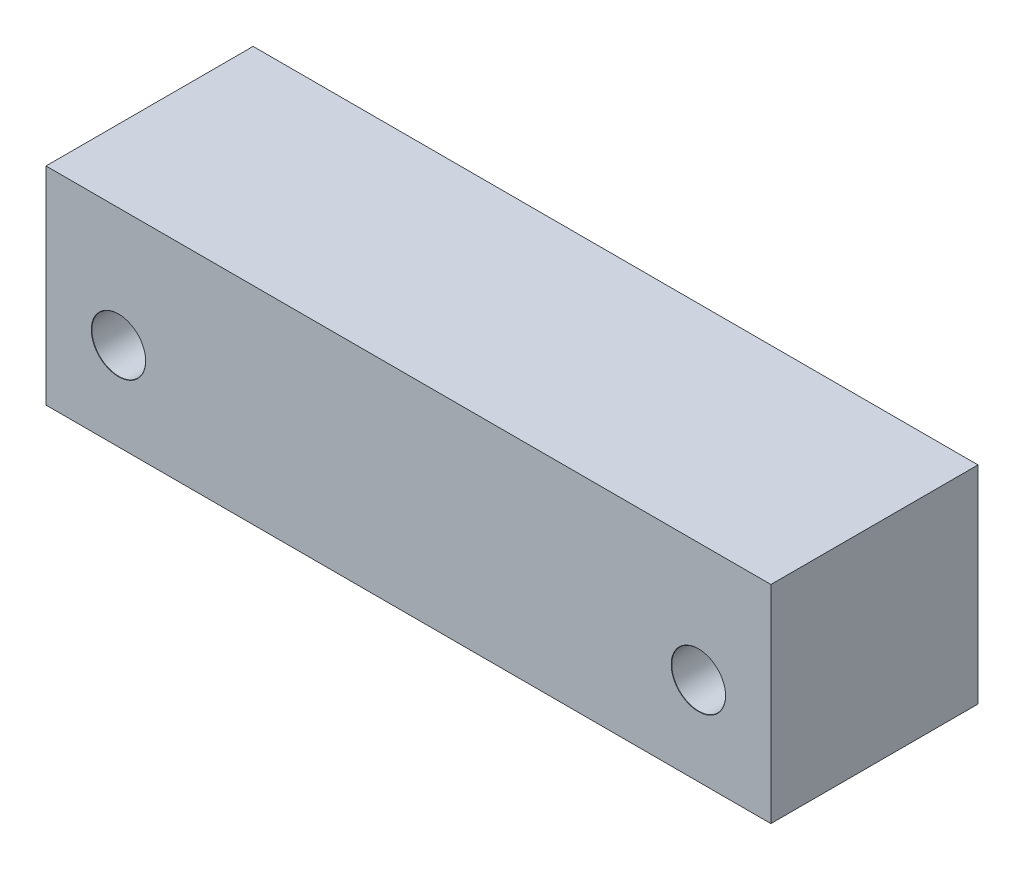
ISO-10303-21;
HEADER;
FILE_DESCRIPTION(('STEP AP214'),'2;1');
FILE_NAME('part.step','',(''),(''),'','','');
FILE_SCHEMA(('AUTOMOTIVE_DESIGN { 1 0 10303 214 1 1 1 1 }'));
ENDSEC;
DATA;
#1=APPLICATION_CONTEXT('core data for automotive mechanical design processes');
#2=APPLICATION_PROTOCOL_DEFINITION('international standard','automotive_design',2000,#1);
#3=PRODUCT_CONTEXT('',#1,'mechanical');
#4=PRODUCT('Part','Part','',(#3));
#5=PRODUCT_RELATED_PRODUCT_CATEGORY('part','',(#4));
#6=PRODUCT_DEFINITION_FORMATION('','',#4);
#7=PRODUCT_DEFINITION_CONTEXT('part definition',#1,'design');
#8=PRODUCT_DEFINITION('design','',#6,#7);
#9=PRODUCT_DEFINITION_SHAPE('','',#8);
#10=(LENGTH_UNIT() NAMED_UNIT(*) SI_UNIT(.MILLI.,.METRE.));
#11=(NAMED_UNIT(*) PLANE_ANGLE_UNIT() SI_UNIT($,.RADIAN.));
#12=(NAMED_UNIT(*) SI_UNIT($,.STERADIAN.) SOLID_ANGLE_UNIT());
#13=UNCERTAINTY_MEASURE_WITH_UNIT(LENGTH_MEASURE(1.E-05),#10,'distance_accuracy_value','');
#14=(GEOMETRIC_REPRESENTATION_CONTEXT(3) GLOBAL_UNCERTAINTY_ASSIGNED_CONTEXT((#13)) GLOBAL_UNIT_ASSIGNED_CONTEXT((#10,
#11,#12)) REPRESENTATION_CONTEXT('',''));
#15=CARTESIAN_POINT('',(0.,0.,0.));
#16=DIRECTION('',(0.,0.,1.));
#17=DIRECTION('',(1.,0.,0.));
#18=AXIS2_PLACEMENT_3D('',#15,#16,#17);
#19=CARTESIAN_POINT('',(-35.,-8.32297536146129,20.));
#20=DIRECTION('',(0.,1.,0.));
#21=DIRECTION('',(-1.,0.,0.));
#22=AXIS2_PLACEMENT_3D('',#19,#20,#21);
#23=PLANE('',#22);
#24=DIRECTION('',(1.,0.,0.));
#25=VECTOR('',#24,1.);
#26=CARTESIAN_POINT('',(-35.,-8.32297536146129,0.));
#27=LINE('',#26,#25);
#28=CARTESIAN_POINT('',(-35.,-8.32297536146129,0.));
#29=VERTEX_POINT('',#28);
#30=CARTESIAN_POINT('',(35.,-8.32297536146128,0.));
#31=VERTEX_POINT('',#30);
#32=EDGE_CURVE('E88',#29,#31,#27,.T.);
#33=ORIENTED_EDGE('',*,*,#32,.T.);
#34=DIRECTION('',(0.,0.,-1.));
#35=VECTOR('',#34,1.);
#36=CARTESIAN_POINT('',(35.,-8.32297536146128,20.));
#37=LINE('',#36,#35);
#38=CARTESIAN_POINT('',(35.,-8.32297536146128,20.));
#39=VERTEX_POINT('',#38);
#40=EDGE_CURVE('E112',#39,#31,#37,.T.);
#41=ORIENTED_EDGE('',*,*,#40,.F.);
#42=DIRECTION('',(1.,0.,0.));
#43=VECTOR('',#42,1.);
#44=CARTESIAN_POINT('',(-35.,-8.32297536146129,20.));
#45=LINE('',#44,#43);
#46=CARTESIAN_POINT('',(-35.,-8.32297536146129,20.));
#47=VERTEX_POINT('',#46);
#48=EDGE_CURVE('E65',#47,#39,#45,.T.);
#49=ORIENTED_EDGE('',*,*,#48,.F.);
#50=DIRECTION('',(0.,0.,-1.));
#51=VECTOR('',#50,1.);
#52=CARTESIAN_POINT('',(-35.,-8.32297536146129,20.));
#53=LINE('',#52,#51);
#54=EDGE_CURVE('E107',#47,#29,#53,.T.);
#55=ORIENTED_EDGE('',*,*,#54,.T.);
#56=EDGE_LOOP('',(#33,#41,#49,#55));
#57=FACE_BOUND('',#56,.T.);
#58=CARTESIAN_POINT('',(-28.,-8.32297536146129,10.));
#59=DIRECTION('',(0.,-1.,0.));
#60=DIRECTION('',(0.,0.,-1.));
#61=AXIS2_PLACEMENT_3D('',#58,#59,#60);
#62=CIRCLE('',#61,1.875);
#63=CARTESIAN_POINT('',(-28.,-8.32297536146129,8.125));
#64=VERTEX_POINT('',#63);
#65=EDGE_CURVE('E196',#64,#64,#62,.T.);
#66=ORIENTED_EDGE('',*,*,#65,.F.);
#67=EDGE_LOOP('',(#66));
#68=FACE_BOUND('',#67,.T.);
#69=CARTESIAN_POINT('',(28.,-8.32297536146128,10.));
#70=DIRECTION('',(0.,-1.,0.));
#71=DIRECTION('',(0.,0.,-1.));
#72=AXIS2_PLACEMENT_3D('',#69,#70,#71);
#73=CIRCLE('',#72,1.875);
#74=CARTESIAN_POINT('',(28.,-8.32297536146128,8.125));
#75=VERTEX_POINT('',#74);
#76=EDGE_CURVE('E212',#75,#75,#73,.T.);
#77=ORIENTED_EDGE('',*,*,#76,.F.);
#78=EDGE_LOOP('',(#77));
#79=FACE_BOUND('',#78,.T.);
#80=ADVANCED_FACE('F47',(#57,#68,#79),#23,.F.);
#81=CARTESIAN_POINT('',(35.,-8.32297536146128,20.));
#82=DIRECTION('',(-1.,0.,0.));
#83=DIRECTION('',(0.,0.,1.));
#84=AXIS2_PLACEMENT_3D('',#81,#82,#83);
#85=PLANE('',#84);
#86=DIRECTION('',(0.,1.,0.));
#87=VECTOR('',#86,1.);
#88=CARTESIAN_POINT('',(35.,-8.32297536146128,0.));
#89=LINE('',#88,#87);
#90=CARTESIAN_POINT('',(35.,11.6770246385387,0.));
#91=VERTEX_POINT('',#90);
#92=EDGE_CURVE('E116',#31,#91,#89,.T.);
#93=ORIENTED_EDGE('',*,*,#92,.T.);
#94=DIRECTION('',(0.,0.,-1.));
#95=VECTOR('',#94,1.);
#96=CARTESIAN_POINT('',(35.,11.6770246385387,20.));
#97=LINE('',#96,#95);
#98=CARTESIAN_POINT('',(35.,11.6770246385387,20.));
#99=VERTEX_POINT('',#98);
#100=EDGE_CURVE('E11',#99,#91,#97,.T.);
#101=ORIENTED_EDGE('',*,*,#100,.F.);
#102=DIRECTION('',(0.,1.,0.));
#103=VECTOR('',#102,1.);
#104=CARTESIAN_POINT('',(35.,-8.32297536146128,20.));
#105=LINE('',#104,#103);
#106=EDGE_CURVE('E100',#39,#99,#105,.T.);
#107=ORIENTED_EDGE('',*,*,#106,.F.);
#108=ORIENTED_EDGE('',*,*,#40,.T.);
#109=EDGE_LOOP('',(#93,#101,#107,#108));
#110=FACE_BOUND('',#109,.T.);
#111=ADVANCED_FACE('F49',(#110),#85,.F.);
#112=CARTESIAN_POINT('',(-35.,11.6770246385387,20.));
#113=DIRECTION('',(0.,-1.,0.));
#114=DIRECTION('',(1.,0.,0.));
#115=AXIS2_PLACEMENT_3D('',#112,#113,#114);
#116=PLANE('',#115);
#117=DIRECTION('',(-1.,0.,0.));
#118=VECTOR('',#117,1.);
#119=CARTESIAN_POINT('',(-35.,11.6770246385387,0.));
#120=LINE('',#119,#118);
#121=CARTESIAN_POINT('',(-35.,11.6770246385387,0.));
#122=VERTEX_POINT('',#121);
#123=EDGE_CURVE('E105',#91,#122,#120,.T.);
#124=ORIENTED_EDGE('',*,*,#123,.T.);
#125=DIRECTION('',(0.,0.,-1.));
#126=VECTOR('',#125,1.);
#127=CARTESIAN_POINT('',(-35.,11.6770246385387,20.));
#128=LINE('',#127,#126);
#129=CARTESIAN_POINT('',(-35.,11.6770246385387,20.));
#130=VERTEX_POINT('',#129);
#131=EDGE_CURVE('E57',#130,#122,#128,.T.);
#132=ORIENTED_EDGE('',*,*,#131,.F.);
#133=DIRECTION('',(-1.,0.,0.));
#134=VECTOR('',#133,1.);
#135=CARTESIAN_POINT('',(-35.,11.6770246385387,20.));
#136=LINE('',#135,#134);
#137=EDGE_CURVE('E95',#99,#130,#136,.T.);
#138=ORIENTED_EDGE('',*,*,#137,.F.);
#139=ORIENTED_EDGE('',*,*,#100,.T.);
#140=EDGE_LOOP('',(#124,#132,#138,#139));
#141=FACE_BOUND('',#140,.T.);
#142=ADVANCED_FACE('F104',(#141),#116,.F.);
#143=CARTESIAN_POINT('',(-35.,-8.32297536146129,20.));
#144=DIRECTION('',(1.,0.,0.));
#145=DIRECTION('',(0.,0.,-1.));
#146=AXIS2_PLACEMENT_3D('',#143,#144,#145);
#147=PLANE('',#146);
#148=DIRECTION('',(0.,-1.,0.));
#149=VECTOR('',#148,1.);
#150=CARTESIAN_POINT('',(-35.,-8.32297536146129,0.));
#151=LINE('',#150,#149);
#152=EDGE_CURVE('E82',#122,#29,#151,.T.);
#153=ORIENTED_EDGE('',*,*,#152,.T.);
#154=ORIENTED_EDGE('',*,*,#54,.F.);
#155=DIRECTION('',(0.,-1.,0.));
#156=VECTOR('',#155,1.);
#157=CARTESIAN_POINT('',(-35.,-8.32297536146129,20.));
#158=LINE('',#157,#156);
#159=EDGE_CURVE('E98',#130,#47,#158,.T.);
#160=ORIENTED_EDGE('',*,*,#159,.F.);
#161=ORIENTED_EDGE('',*,*,#131,.T.);
#162=EDGE_LOOP('',(#153,#154,#160,#161));
#163=FACE_BOUND('',#162,.T.);
#164=ADVANCED_FACE('F108',(#163),#147,.F.);
#165=CARTESIAN_POINT('',(0.,0.,20.));
#166=DIRECTION('',(0.,0.,-1.));
#167=DIRECTION('',(-1.,0.,0.));
#168=AXIS2_PLACEMENT_3D('',#165,#166,#167);
#169=PLANE('',#168);
#170=CARTESIAN_POINT('',(-28.,0.177024638538715,20.));
#171=DIRECTION('',(0.,0.,1.));
#172=DIRECTION('',(1.,0.,0.));
#173=AXIS2_PLACEMENT_3D('',#170,#171,#172);
#174=CIRCLE('',#173,2.625);
#175=CARTESIAN_POINT('',(-25.375,0.177024638538715,20.));
#176=VERTEX_POINT('',#175);
#177=EDGE_CURVE('E156',#176,#176,#174,.T.);
#178=ORIENTED_EDGE('',*,*,#177,.F.);
#179=EDGE_LOOP('',(#178));
#180=FACE_BOUND('',#179,.T.);
#181=CARTESIAN_POINT('',(28.,0.177024638538715,20.));
#182=DIRECTION('',(0.,0.,1.));
#183=DIRECTION('',(1.,0.,0.));
#184=AXIS2_PLACEMENT_3D('',#181,#182,#183);
#185=CIRCLE('',#184,2.625);
#186=CARTESIAN_POINT('',(30.625,0.177024638538715,20.));
#187=VERTEX_POINT('',#186);
#188=EDGE_CURVE('E144',#187,#187,#185,.T.);
#189=ORIENTED_EDGE('',*,*,#188,.F.);
#190=EDGE_LOOP('',(#189));
#191=FACE_BOUND('',#190,.T.);
#192=ORIENTED_EDGE('',*,*,#106,.T.);
#193=ORIENTED_EDGE('',*,*,#137,.T.);
#194=ORIENTED_EDGE('',*,*,#159,.T.);
#195=ORIENTED_EDGE('',*,*,#48,.T.);
#196=EDGE_LOOP('',(#192,#193,#194,#195));
#197=FACE_BOUND('',#196,.T.);
#198=ADVANCED_FACE('F96',(#180,#191,#197),#169,.F.);
#199=CARTESIAN_POINT('',(0.,0.,0.));
#200=DIRECTION('',(0.,0.,-1.));
#201=DIRECTION('',(-1.,0.,0.));
#202=AXIS2_PLACEMENT_3D('',#199,#200,#201);
#203=PLANE('',#202);
#204=CARTESIAN_POINT('',(0.,0.,0.));
#205=DIRECTION('',(0.,0.,-1.));
#206=DIRECTION('',(-1.,0.,0.));
#207=AXIS2_PLACEMENT_3D('',#204,#205,#206);
#208=CIRCLE('',#207,6.05);
#209=CARTESIAN_POINT('',(-6.05,0.,0.));
#210=VERTEX_POINT('',#209);
#211=EDGE_CURVE('E220',#210,#210,#208,.T.);
#212=ORIENTED_EDGE('',*,*,#211,.F.);
#213=EDGE_LOOP('',(#212));
#214=FACE_BOUND('',#213,.T.);
#215=CARTESIAN_POINT('',(-28.,0.177024638538715,0.));
#216=DIRECTION('',(0.,0.,1.));
#217=DIRECTION('',(1.,0.,0.));
#218=AXIS2_PLACEMENT_3D('',#215,#216,#217);
#219=CIRCLE('',#218,2.59999999999999);
#220=CARTESIAN_POINT('',(-25.4,0.177024638538715,0.));
#221=VERTEX_POINT('',#220);
#222=EDGE_CURVE('E148',#221,#221,#219,.T.);
#223=ORIENTED_EDGE('',*,*,#222,.T.);
#224=EDGE_LOOP('',(#223));
#225=FACE_BOUND('',#224,.T.);
#226=CARTESIAN_POINT('',(28.,0.177024638538715,0.));
#227=DIRECTION('',(0.,0.,1.));
#228=DIRECTION('',(1.,0.,0.));
#229=AXIS2_PLACEMENT_3D('',#226,#227,#228);
#230=CIRCLE('',#229,2.59999999999999);
#231=CARTESIAN_POINT('',(30.6,0.177024638538715,0.));
#232=VERTEX_POINT('',#231);
#233=EDGE_CURVE('E120',#232,#232,#230,.T.);
#234=ORIENTED_EDGE('',*,*,#233,.T.);
#235=EDGE_LOOP('',(#234));
#236=FACE_BOUND('',#235,.T.);
#237=ORIENTED_EDGE('',*,*,#92,.F.);
#238=ORIENTED_EDGE('',*,*,#32,.F.);
#239=ORIENTED_EDGE('',*,*,#152,.F.);
#240=ORIENTED_EDGE('',*,*,#123,.F.);
#241=EDGE_LOOP('',(#237,#238,#239,#240));
#242=FACE_BOUND('',#241,.T.);
#243=ADVANCED_FACE('F133',(#214,#225,#236,#242),#203,.T.);
#244=CARTESIAN_POINT('',(28.,0.177024638538715,20.));
#245=DIRECTION('',(0.,0.,1.));
#246=DIRECTION('',(1.,0.,0.));
#247=AXIS2_PLACEMENT_3D('',#244,#245,#246);
#248=CYLINDRICAL_SURFACE('',#247,2.6);
#249=CARTESIAN_POINT('',(28.,-2.42297536146128,8.15));
#250=CARTESIAN_POINT('',(28.0916377536567,-2.42297620408231,8.14999902368044));
#251=CARTESIAN_POINT('',(28.1832726374046,-2.41808984179308,8.15684754190672));
#252=CARTESIAN_POINT('',(28.3635847266049,-2.39902584023698,8.18378816466708));
#253=CARTESIAN_POINT('',(28.4522604540695,-2.38484362892919,8.20388678611814));
#254=CARTESIAN_POINT('',(28.6237480047803,-2.3485628313287,8.25602763566196));
#255=CARTESIAN_POINT('',(28.7065867762643,-2.32650393165401,8.28801001975176));
#256=CARTESIAN_POINT('',(28.8652958247506,-2.27617808226703,8.36248477931392));
#257=CARTESIAN_POINT('',(28.9411651992312,-2.24791033012465,8.40497851335941));
#258=CARTESIAN_POINT('',(29.0914622230301,-2.18432019662774,8.50334140107353));
#259=CARTESIAN_POINT('',(29.1651545936005,-2.14859305571842,8.56006669710438));
#260=CARTESIAN_POINT('',(29.3026365747868,-2.07447540511952,8.68312232207573));
#261=CARTESIAN_POINT('',(29.3664110716912,-2.03608095709291,8.74946701830555));
#262=CARTESIAN_POINT('',(29.4941942708556,-1.95234539443975,8.90378556599427));
#263=CARTESIAN_POINT('',(29.5561238812018,-1.90701459684446,8.99349729779703));
#264=CARTESIAN_POINT('',(29.664107284928,-1.82184088423302,9.18438543120425));
#265=CARTESIAN_POINT('',(29.7101865809935,-1.7819892160801,9.28554306480652));
#266=CARTESIAN_POINT('',(29.7723796739076,-1.7255637784439,9.46424398208446));
#267=CARTESIAN_POINT('',(29.7933635487827,-1.70562032495923,9.53901457904804));
#268=CARTESIAN_POINT('',(29.8258912686161,-1.67409452150144,9.69222365294627));
#269=CARTESIAN_POINT('',(29.8374549506242,-1.66249460776094,9.77065405265238));
#270=CARTESIAN_POINT('',(29.8503949008482,-1.64948443280752,9.92974023465067));
#271=CARTESIAN_POINT('',(29.8517067123694,-1.6481386437836,10.0104069020184));
#272=CARTESIAN_POINT('',(29.8438569801911,-1.65606425488261,10.1707256867612));
#273=CARTESIAN_POINT('',(29.8346866199498,-1.66534459263904,10.2503768930197));
#274=CARTESIAN_POINT('',(29.8047505753019,-1.69470095277817,10.4164106115647));
#275=CARTESIAN_POINT('',(29.7826298939443,-1.71602592794039,10.5023181597418));
#276=CARTESIAN_POINT('',(29.7273781711793,-1.76656960018862,10.6680849864124));
#277=CARTESIAN_POINT('',(29.6942229476701,-1.79580560768926,10.7479305038314));
#278=CARTESIAN_POINT('',(29.6064981185447,-1.86828635779281,10.9241702432018));
#279=CARTESIAN_POINT('',(29.5484821022836,-1.91308632482959,11.0182030774331));
#280=CARTESIAN_POINT('',(29.4172323976322,-2.0042268906327,11.1941570915748));
#281=CARTESIAN_POINT('',(29.3439840843211,-2.05056893380193,11.2760665011427));
#282=CARTESIAN_POINT('',(29.1823292250942,-2.14046066002334,11.4272170531524));
#283=CARTESIAN_POINT('',(29.0937873467002,-2.18398018143194,11.4963325798214));
#284=CARTESIAN_POINT('',(28.9032186695554,-2.26321696525459,11.6184655268364));
#285=CARTESIAN_POINT('',(28.8012234571006,-2.29895199878155,11.6715197237314));
#286=CARTESIAN_POINT('',(28.613655426542,-2.35088883489955,11.7473965113529));
#287=CARTESIAN_POINT('',(28.530535085756,-2.36974823104409,11.7744790182205));
#288=CARTESIAN_POINT('',(28.3599373477387,-2.39939084258953,11.8167685186361));
#289=CARTESIAN_POINT('',(28.2724631538397,-2.41017990470411,11.8319841097484));
#290=CARTESIAN_POINT('',(28.0953056482558,-2.42274933852941,11.8496929772196));
#291=CARTESIAN_POINT('',(28.0056163873377,-2.42450199703525,11.8521471164431));
#292=CARTESIAN_POINT('',(27.8271211243658,-2.41875795859523,11.844070309554));
#293=CARTESIAN_POINT('',(27.7383152278138,-2.41126016991233,11.833537830762));
#294=CARTESIAN_POINT('',(27.5682822360121,-2.38825320347422,11.800909654261));
#295=CARTESIAN_POINT('',(27.4868943651388,-2.37312745686343,11.7793667714427));
#296=CARTESIAN_POINT('',(27.329147466946,-2.33624533613003,11.7260922654585));
#297=CARTESIAN_POINT('',(27.2527894576257,-2.31448762474057,11.6943585873553));
#298=CARTESIAN_POINT('',(27.0995433357589,-2.26352592057473,11.6185329396496));
#299=CARTESIAN_POINT('',(27.0232558811065,-2.23382023150541,11.5735710939094));
#300=CARTESIAN_POINT('',(26.8789749979133,-2.1702146366338,11.4742748229252));
#301=CARTESIAN_POINT('',(26.8109882618058,-2.13631139033682,11.4199329191233));
#302=CARTESIAN_POINT('',(26.672345340779,-2.06008535738159,11.2923789629824));
#303=CARTESIAN_POINT('',(26.6034209262293,-2.01734717224317,11.2175312733859));
#304=CARTESIAN_POINT('',(26.4784793792421,-1.93263586556634,11.0572641412611));
#305=CARTESIAN_POINT('',(26.4224683644759,-1.89066311528512,10.9718397173817));
#306=CARTESIAN_POINT('',(26.3323903910808,-1.81843410520075,10.8056121500049));
#307=CARTESIAN_POINT('',(26.2962404327448,-1.78738034154109,10.7262903013343));
#308=CARTESIAN_POINT('',(26.2349777170634,-1.7325286205464,10.5611694495105));
#309=CARTESIAN_POINT('',(26.2098415903593,-1.70871533343804,10.4753846176821));
#310=CARTESIAN_POINT('',(26.175465989959,-1.67541915212611,10.3147202283588));
#311=CARTESIAN_POINT('',(26.1641767995389,-1.66412604296461,10.2406651389604));
#312=CARTESIAN_POINT('',(26.1507126452363,-1.65060651840483,10.0909373707071));
#313=CARTESIAN_POINT('',(26.14852812521,-1.64837059676949,10.015266471704));
#314=CARTESIAN_POINT('',(26.153423641081,-1.65332071634026,9.86457005634122));
#315=CARTESIAN_POINT('',(26.1605017245979,-1.66050477199511,9.7895444073299));
#316=CARTESIAN_POINT('',(26.1834125583577,-1.68315297042343,9.64209190449724));
#317=CARTESIAN_POINT('',(26.1992587468576,-1.69862982182595,9.56966922195625));
#318=CARTESIAN_POINT('',(26.2457232086429,-1.74230817257526,9.40442255098797));
#319=CARTESIAN_POINT('',(26.2795527183779,-1.77305805431226,9.31318762837262));
#320=CARTESIAN_POINT('',(26.3597431044448,-1.84097374437851,9.13901795841271));
#321=CARTESIAN_POINT('',(26.4061247449956,-1.87815014656177,9.0560972791255));
#322=CARTESIAN_POINT('',(26.5116717247236,-1.95588181418958,8.8969471545206));
#323=CARTESIAN_POINT('',(26.5711410340357,-1.99650020724776,8.82095087374573));
#324=CARTESIAN_POINT('',(26.7014525744442,-2.07678090547429,8.67879826363899));
#325=CARTESIAN_POINT('',(26.7722986341583,-2.11644288359397,8.61264526135543));
#326=CARTESIAN_POINT('',(26.9372092368224,-2.19789446349769,8.48151703621189));
#327=CARTESIAN_POINT('',(27.0331758248291,-2.23899034023159,8.41846348377212));
#328=CARTESIAN_POINT('',(27.2380867606486,-2.31118990578476,8.31022680629191));
#329=CARTESIAN_POINT('',(27.3470064208291,-2.34231219798123,8.26501037346289));
#330=CARTESIAN_POINT('',(27.5467853070047,-2.38468920407595,8.20410900045389));
#331=CARTESIAN_POINT('',(27.6356482858314,-2.39892757104289,8.18392812777353));
#332=CARTESIAN_POINT('',(27.8163435207033,-2.41806628280726,8.15687974084337));
#333=CARTESIAN_POINT('',(27.9081732012326,-2.42297451710196,8.15000097833367));
#334=CARTESIAN_POINT('',(28.,-2.42297536146128,8.15));
#335=B_SPLINE_CURVE_WITH_KNOTS('',3,(#249,#250,#251,#252,#253,#254,#255,#256,#257,#258,#259,
#260,#261,#262,#263,#264,#265,#266,#267,#268,#269,#270,#271,#272,#273,#274,#275,#276,#277,#278,
#279,#280,#281,#282,#283,#284,#285,#286,#287,#288,#289,#290,#291,#292,#293,#294,#295,#296,#297,
#298,#299,#300,#301,#302,#303,#304,#305,#306,#307,#308,#309,#310,#311,#312,#313,#314,#315,#316,
#317,#318,#319,#320,#321,#322,#323,#324,#325,#326,#327,#328,#329,#330,#331,#332,#333,#334),
.UNSPECIFIED.,.T.,.F.,(4,2,2,2,2,2,2,2,2,2,2,2,2,2,2,2,2,2,2,2,2,2,2,2,2,2,2,2,2,2,2,2,2,2,2,2,
2,2,2,2,2,2,4),(0.,0.274538871367903,0.549212872487849,0.822522019236357,1.09586650917636,
1.39364823629986,1.69187939378721,2.04450854586235,2.39656764470794,2.63621877444508,
2.87536393253849,3.1160114703548,3.35686156555365,3.62908975578287,3.901918503762,
4.25779954628599,4.614023870146,4.97357906075887,5.33230461928069,5.59947510022626,
5.86645183624758,6.1342468622578,6.40207349643913,6.65760959821264,6.91319726031262,
7.19235814231239,7.47174263125574,7.80153789276909,8.13148907387683,8.40815930999784,
8.68423962509949,8.91051526767193,9.13655335436747,9.36254380421003,9.58888157692338,
9.89336253783793,10.1983502947052,10.511354529432,10.8244643210733,11.1882251609067,
11.5513034868837,11.8266416490745,12.1017468834233),.UNSPECIFIED.);
#336=CARTESIAN_POINT('',(28.,-2.42297536146128,8.15));
#337=VERTEX_POINT('',#336);
#338=EDGE_CURVE('E189',#337,#337,#335,.T.);
#339=ORIENTED_EDGE('',*,*,#338,.T.);
#340=EDGE_LOOP('',(#339));
#341=FACE_BOUND('',#340,.T.);
#342=ORIENTED_EDGE('',*,*,#233,.F.);
#343=EDGE_LOOP('',(#342));
#344=FACE_BOUND('',#343,.T.);
#345=CARTESIAN_POINT('',(28.,0.177024638538715,19.975));
#346=DIRECTION('',(0.,0.,1.));
#347=DIRECTION('',(1.,0.,0.));
#348=AXIS2_PLACEMENT_3D('',#345,#346,#347);
#349=CIRCLE('',#348,2.6);
#350=CARTESIAN_POINT('',(30.6,0.177024638538715,19.975));
#351=VERTEX_POINT('',#350);
#352=EDGE_CURVE('E140',#351,#351,#349,.T.);
#353=ORIENTED_EDGE('',*,*,#352,.T.);
#354=EDGE_LOOP('',(#353));
#355=FACE_BOUND('',#354,.T.);
#356=ADVANCED_FACE('F258',(#341,#344,#355),#248,.F.);
#357=CARTESIAN_POINT('',(28.,0.177024638538715,20.));
#358=DIRECTION('',(0.,0.,1.));
#359=DIRECTION('',(1.,0.,0.));
#360=AXIS2_PLACEMENT_3D('',#357,#358,#359);
#361=CONICAL_SURFACE('',#360,2.625,0.785398163397448);
#362=ORIENTED_EDGE('',*,*,#352,.F.);
#363=EDGE_LOOP('',(#362));
#364=FACE_BOUND('',#363,.T.);
#365=ORIENTED_EDGE('',*,*,#188,.T.);
#366=EDGE_LOOP('',(#365));
#367=FACE_BOUND('',#366,.T.);
#368=ADVANCED_FACE('F266',(#364,#367),#361,.F.);
#369=CARTESIAN_POINT('',(-28.,0.177024638538715,20.));
#370=DIRECTION('',(0.,0.,1.));
#371=DIRECTION('',(1.,0.,0.));
#372=AXIS2_PLACEMENT_3D('',#369,#370,#371);
#373=CYLINDRICAL_SURFACE('',#372,2.6);
#374=CARTESIAN_POINT('',(-28.,-2.42297536146128,8.15));
#375=CARTESIAN_POINT('',(-27.9083622463433,-2.42297620408231,8.14999902368044));
#376=CARTESIAN_POINT('',(-27.8167273625954,-2.41808984179308,8.15684754190672));
#377=CARTESIAN_POINT('',(-27.6364152733951,-2.39902584023698,8.18378816466708));
#378=CARTESIAN_POINT('',(-27.5477395459305,-2.38484362892919,8.20388678611814));
#379=CARTESIAN_POINT('',(-27.3762519952197,-2.3485628313287,8.25602763566196));
#380=CARTESIAN_POINT('',(-27.2934132237357,-2.32650393165401,8.28801001975176));
#381=CARTESIAN_POINT('',(-27.1347041752494,-2.27617808226703,8.36248477931392));
#382=CARTESIAN_POINT('',(-27.0588348007688,-2.24791033012465,8.40497851335941));
#383=CARTESIAN_POINT('',(-26.9085377769699,-2.18432019662774,8.50334140107353));
#384=CARTESIAN_POINT('',(-26.8348454063995,-2.14859305571842,8.56006669710438));
#385=CARTESIAN_POINT('',(-26.6973634252132,-2.07447540511952,8.68312232207573));
#386=CARTESIAN_POINT('',(-26.6335889283088,-2.03608095709291,8.74946701830555));
#387=CARTESIAN_POINT('',(-26.5058057291444,-1.95234539443975,8.90378556599427));
#388=CARTESIAN_POINT('',(-26.4438761187982,-1.90701459684446,8.99349729779703));
#389=CARTESIAN_POINT('',(-26.335892715072,-1.82184088423302,9.18438543120425));
#390=CARTESIAN_POINT('',(-26.2898134190065,-1.7819892160801,9.28554306480652));
#391=CARTESIAN_POINT('',(-26.2276203260924,-1.7255637784439,9.46424398208446));
#392=CARTESIAN_POINT('',(-26.2066364512173,-1.70562032495923,9.53901457904804));
#393=CARTESIAN_POINT('',(-26.1741087313839,-1.67409452150144,9.69222365294627));
#394=CARTESIAN_POINT('',(-26.1625450493758,-1.66249460776094,9.77065405265238));
#395=CARTESIAN_POINT('',(-26.1496050991518,-1.64948443280752,9.92974023465067));
#396=CARTESIAN_POINT('',(-26.1482932876306,-1.6481386437836,10.0104069020184));
#397=CARTESIAN_POINT('',(-26.1561430198089,-1.65606425488261,10.1707256867612));
#398=CARTESIAN_POINT('',(-26.1653133800502,-1.66534459263904,10.2503768930197));
#399=CARTESIAN_POINT('',(-26.1952494246981,-1.69470095277817,10.4164106115647));
#400=CARTESIAN_POINT('',(-26.2173701060557,-1.71602592794039,10.5023181597418));
#401=CARTESIAN_POINT('',(-26.2726218288207,-1.76656960018862,10.6680849864124));
#402=CARTESIAN_POINT('',(-26.3057770523299,-1.79580560768926,10.7479305038314));
#403=CARTESIAN_POINT('',(-26.3935018814553,-1.86828635779281,10.9241702432018));
#404=CARTESIAN_POINT('',(-26.4515178977164,-1.91308632482959,11.0182030774331));
#405=CARTESIAN_POINT('',(-26.5827676023678,-2.0042268906327,11.1941570915748));
#406=CARTESIAN_POINT('',(-26.6560159156789,-2.05056893380193,11.2760665011427));
#407=CARTESIAN_POINT('',(-26.8176707749058,-2.14046066002334,11.4272170531524));
#408=CARTESIAN_POINT('',(-26.9062126532998,-2.18398018143194,11.4963325798214));
#409=CARTESIAN_POINT('',(-27.0967813304446,-2.26321696525459,11.6184655268364));
#410=CARTESIAN_POINT('',(-27.1987765428994,-2.29895199878155,11.6715197237314));
#411=CARTESIAN_POINT('',(-27.386344573458,-2.35088883489955,11.7473965113529));
#412=CARTESIAN_POINT('',(-27.469464914244,-2.36974823104409,11.7744790182205));
#413=CARTESIAN_POINT('',(-27.6400626522613,-2.39939084258953,11.8167685186361));
#414=CARTESIAN_POINT('',(-27.7275368461603,-2.41017990470411,11.8319841097484));
#415=CARTESIAN_POINT('',(-27.9046943517442,-2.42274933852941,11.8496929772196));
#416=CARTESIAN_POINT('',(-27.9943836126623,-2.42450199703525,11.8521471164431));
#417=CARTESIAN_POINT('',(-28.1728788756342,-2.41875795859523,11.844070309554));
#418=CARTESIAN_POINT('',(-28.2616847721862,-2.41126016991233,11.833537830762));
#419=CARTESIAN_POINT('',(-28.4317177639879,-2.38825320347422,11.800909654261));
#420=CARTESIAN_POINT('',(-28.5131056348612,-2.37312745686343,11.7793667714427));
#421=CARTESIAN_POINT('',(-28.670852533054,-2.33624533613003,11.7260922654585));
#422=CARTESIAN_POINT('',(-28.7472105423743,-2.31448762474057,11.6943585873553));
#423=CARTESIAN_POINT('',(-28.9004566642411,-2.26352592057473,11.6185329396496));
#424=CARTESIAN_POINT('',(-28.9767441188935,-2.23382023150541,11.5735710939094));
#425=CARTESIAN_POINT('',(-29.1210250020867,-2.1702146366338,11.4742748229252));
#426=CARTESIAN_POINT('',(-29.1890117381942,-2.13631139033682,11.4199329191233));
#427=CARTESIAN_POINT('',(-29.327654659221,-2.06008535738159,11.2923789629824));
#428=CARTESIAN_POINT('',(-29.3965790737707,-2.01734717224317,11.2175312733859));
#429=CARTESIAN_POINT('',(-29.5215206207579,-1.93263586556634,11.0572641412611));
#430=CARTESIAN_POINT('',(-29.5775316355241,-1.89066311528512,10.9718397173817));
#431=CARTESIAN_POINT('',(-29.6676096089192,-1.81843410520075,10.8056121500049));
#432=CARTESIAN_POINT('',(-29.7037595672552,-1.78738034154109,10.7262903013343));
#433=CARTESIAN_POINT('',(-29.7650222829366,-1.7325286205464,10.5611694495105));
#434=CARTESIAN_POINT('',(-29.7901584096407,-1.70871533343804,10.4753846176821));
#435=CARTESIAN_POINT('',(-29.824534010041,-1.67541915212611,10.3147202283588));
#436=CARTESIAN_POINT('',(-29.8358232004611,-1.66412604296461,10.2406651389604));
#437=CARTESIAN_POINT('',(-29.8492873547637,-1.65060651840483,10.0909373707071));
#438=CARTESIAN_POINT('',(-29.85147187479,-1.64837059676949,10.015266471704));
#439=CARTESIAN_POINT('',(-29.846576358919,-1.65332071634026,9.86457005634122));
#440=CARTESIAN_POINT('',(-29.8394982754021,-1.66050477199511,9.7895444073299));
#441=CARTESIAN_POINT('',(-29.8165874416423,-1.68315297042343,9.64209190449724));
#442=CARTESIAN_POINT('',(-29.8007412531424,-1.69862982182595,9.56966922195625));
#443=CARTESIAN_POINT('',(-29.7542767913571,-1.74230817257526,9.40442255098797));
#444=CARTESIAN_POINT('',(-29.7204472816221,-1.77305805431226,9.31318762837262));
#445=CARTESIAN_POINT('',(-29.6402568955552,-1.84097374437851,9.13901795841271));
#446=CARTESIAN_POINT('',(-29.5938752550044,-1.87815014656177,9.0560972791255));
#447=CARTESIAN_POINT('',(-29.4883282752764,-1.95588181418958,8.8969471545206));
#448=CARTESIAN_POINT('',(-29.4288589659643,-1.99650020724777,8.82095087374573));
#449=CARTESIAN_POINT('',(-29.2985474255558,-2.07678090547429,8.67879826363899));
#450=CARTESIAN_POINT('',(-29.2277013658417,-2.11644288359397,8.61264526135543));
#451=CARTESIAN_POINT('',(-29.0627907631776,-2.19789446349769,8.48151703621189));
#452=CARTESIAN_POINT('',(-28.9668241751709,-2.23899034023159,8.41846348377211));
#453=CARTESIAN_POINT('',(-28.7619132393514,-2.31118990578476,8.31022680629191));
#454=CARTESIAN_POINT('',(-28.6529935791709,-2.34231219798123,8.26501037346289));
#455=CARTESIAN_POINT('',(-28.4532146929953,-2.38468920407595,8.20410900045389));
#456=CARTESIAN_POINT('',(-28.3643517141686,-2.39892757104289,8.18392812777353));
#457=CARTESIAN_POINT('',(-28.1836564792967,-2.41806628280726,8.15687974084337));
#458=CARTESIAN_POINT('',(-28.0918267987674,-2.42297451710196,8.15000097833367));
#459=CARTESIAN_POINT('',(-28.,-2.42297536146128,8.15));
#460=B_SPLINE_CURVE_WITH_KNOTS('',3,(#374,#375,#376,#377,#378,#379,#380,#381,#382,#383,#384,
#385,#386,#387,#388,#389,#390,#391,#392,#393,#394,#395,#396,#397,#398,#399,#400,#401,#402,#403,
#404,#405,#406,#407,#408,#409,#410,#411,#412,#413,#414,#415,#416,#417,#418,#419,#420,#421,#422,
#423,#424,#425,#426,#427,#428,#429,#430,#431,#432,#433,#434,#435,#436,#437,#438,#439,#440,#441,
#442,#443,#444,#445,#446,#447,#448,#449,#450,#451,#452,#453,#454,#455,#456,#457,#458,#459),
.UNSPECIFIED.,.T.,.F.,(4,2,2,2,2,2,2,2,2,2,2,2,2,2,2,2,2,2,2,2,2,2,2,2,2,2,2,2,2,2,2,2,2,2,2,2,
2,2,2,2,2,2,4),(0.,0.274538871367903,0.549212872487849,0.82252201923636,1.09586650917636,
1.39364823629987,1.69187939378721,2.04450854586235,2.39656764470794,2.63621877444508,
2.87536393253849,3.1160114703548,3.35686156555365,3.62908975578287,3.901918503762,
4.25779954628599,4.614023870146,4.97357906075887,5.33230461928069,5.59947510022626,
5.86645183624758,6.13424686225779,6.40207349643913,6.65760959821265,6.91319726031262,
7.19235814231239,7.47174263125574,7.80153789276909,8.13148907387683,8.40815930999784,
8.68423962509949,8.91051526767193,9.13655335436747,9.36254380421003,9.58888157692338,
9.89336253783793,10.1983502947052,10.511354529432,10.8244643210733,11.1882251609067,
11.5513034868837,11.8266416490745,12.1017468834233),.UNSPECIFIED.);
#461=CARTESIAN_POINT('',(-28.,-2.42297536146128,8.15));
#462=VERTEX_POINT('',#461);
#463=EDGE_CURVE('E160',#462,#462,#460,.T.);
#464=ORIENTED_EDGE('',*,*,#463,.T.);
#465=EDGE_LOOP('',(#464));
#466=FACE_BOUND('',#465,.T.);
#467=ORIENTED_EDGE('',*,*,#222,.F.);
#468=EDGE_LOOP('',(#467));
#469=FACE_BOUND('',#468,.T.);
#470=CARTESIAN_POINT('',(-28.,0.177024638538715,19.975));
#471=DIRECTION('',(0.,0.,1.));
#472=DIRECTION('',(1.,0.,0.));
#473=AXIS2_PLACEMENT_3D('',#470,#471,#472);
#474=CIRCLE('',#473,2.6);
#475=CARTESIAN_POINT('',(-25.4,0.177024638538715,19.975));
#476=VERTEX_POINT('',#475);
#477=EDGE_CURVE('E152',#476,#476,#474,.T.);
#478=ORIENTED_EDGE('',*,*,#477,.T.);
#479=EDGE_LOOP('',(#478));
#480=FACE_BOUND('',#479,.T.);
#481=ADVANCED_FACE('F273',(#466,#469,#480),#373,.F.);
#482=CARTESIAN_POINT('',(-28.,0.177024638538715,20.));
#483=DIRECTION('',(0.,0.,1.));
#484=DIRECTION('',(1.,0.,0.));
#485=AXIS2_PLACEMENT_3D('',#482,#483,#484);
#486=CONICAL_SURFACE('',#485,2.625,0.785398163397448);
#487=ORIENTED_EDGE('',*,*,#477,.F.);
#488=EDGE_LOOP('',(#487));
#489=FACE_BOUND('',#488,.T.);
#490=ORIENTED_EDGE('',*,*,#177,.T.);
#491=EDGE_LOOP('',(#490));
#492=FACE_BOUND('',#491,.T.);
#493=ADVANCED_FACE('F178',(#489,#492),#486,.F.);
#494=CARTESIAN_POINT('',(-28.,-8.32297536146129,10.));
#495=DIRECTION('',(0.,-1.,0.));
#496=DIRECTION('',(0.,0.,-1.));
#497=AXIS2_PLACEMENT_3D('',#494,#495,#496);
#498=CYLINDRICAL_SURFACE('',#497,1.85);
#499=ORIENTED_EDGE('',*,*,#463,.F.);
#500=EDGE_LOOP('',(#499));
#501=FACE_BOUND('',#500,.T.);
#502=CARTESIAN_POINT('',(-28.,-8.29797536146129,10.));
#503=DIRECTION('',(0.,-1.,0.));
#504=DIRECTION('',(0.,0.,-1.));
#505=AXIS2_PLACEMENT_3D('',#502,#503,#504);
#506=CIRCLE('',#505,1.85);
#507=CARTESIAN_POINT('',(-28.,-8.29797536146129,8.15));
#508=VERTEX_POINT('',#507);
#509=EDGE_CURVE('E169',#508,#508,#506,.T.);
#510=ORIENTED_EDGE('',*,*,#509,.T.);
#511=EDGE_LOOP('',(#510));
#512=FACE_BOUND('',#511,.T.);
#513=ADVANCED_FACE('F173',(#501,#512),#498,.F.);
#514=CARTESIAN_POINT('',(-28.,-8.32297536146129,10.));
#515=DIRECTION('',(0.,-1.,0.));
#516=DIRECTION('',(0.,0.,-1.));
#517=AXIS2_PLACEMENT_3D('',#514,#515,#516);
#518=CONICAL_SURFACE('',#517,1.875,0.785398163397552);
#519=ORIENTED_EDGE('',*,*,#509,.F.);
#520=EDGE_LOOP('',(#519));
#521=FACE_BOUND('',#520,.T.);
#522=ORIENTED_EDGE('',*,*,#65,.T.);
#523=EDGE_LOOP('',(#522));
#524=FACE_BOUND('',#523,.T.);
#525=ADVANCED_FACE('F177',(#521,#524),#518,.F.);
#526=CARTESIAN_POINT('',(28.,-8.32297536146128,10.));
#527=DIRECTION('',(0.,-1.,0.));
#528=DIRECTION('',(0.,0.,-1.));
#529=AXIS2_PLACEMENT_3D('',#526,#527,#528);
#530=CYLINDRICAL_SURFACE('',#529,1.85);
#531=ORIENTED_EDGE('',*,*,#338,.F.);
#532=EDGE_LOOP('',(#531));
#533=FACE_BOUND('',#532,.T.);
#534=CARTESIAN_POINT('',(28.,-8.29797536146128,10.));
#535=DIRECTION('',(0.,-1.,0.));
#536=DIRECTION('',(0.,0.,-1.));
#537=AXIS2_PLACEMENT_3D('',#534,#535,#536);
#538=CIRCLE('',#537,1.85);
#539=CARTESIAN_POINT('',(28.,-8.29797536146128,8.15));
#540=VERTEX_POINT('',#539);
#541=EDGE_CURVE('E197',#540,#540,#538,.T.);
#542=ORIENTED_EDGE('',*,*,#541,.T.);
#543=EDGE_LOOP('',(#542));
#544=FACE_BOUND('',#543,.T.);
#545=ADVANCED_FACE('F182',(#533,#544),#530,.F.);
#546=CARTESIAN_POINT('',(28.,-8.32297536146128,10.));
#547=DIRECTION('',(0.,-1.,0.));
#548=DIRECTION('',(0.,0.,-1.));
#549=AXIS2_PLACEMENT_3D('',#546,#547,#548);
#550=CONICAL_SURFACE('',#549,1.875,0.785398163397552);
#551=ORIENTED_EDGE('',*,*,#541,.F.);
#552=EDGE_LOOP('',(#551));
#553=FACE_BOUND('',#552,.T.);
#554=ORIENTED_EDGE('',*,*,#76,.T.);
#555=EDGE_LOOP('',(#554));
#556=FACE_BOUND('',#555,.T.);
#557=ADVANCED_FACE('F252',(#553,#556),#550,.F.);
#558=CARTESIAN_POINT('',(0.,0.,7.));
#559=DIRECTION('',(0.,0.,-1.));
#560=DIRECTION('',(-1.,0.,0.));
#561=AXIS2_PLACEMENT_3D('',#558,#559,#560);
#562=CYLINDRICAL_SURFACE('',#561,6.05);
#563=CARTESIAN_POINT('',(0.,0.,7.));
#564=DIRECTION('',(0.,0.,-1.));
#565=DIRECTION('',(-1.,0.,0.));
#566=AXIS2_PLACEMENT_3D('',#563,#564,#565);
#567=CIRCLE('',#566,6.05);
#568=CARTESIAN_POINT('',(-6.05,0.,7.));
#569=VERTEX_POINT('',#568);
#570=EDGE_CURVE('E215',#569,#569,#567,.T.);
#571=ORIENTED_EDGE('',*,*,#570,.F.);
#572=EDGE_LOOP('',(#571));
#573=FACE_BOUND('',#572,.T.);
#574=ORIENTED_EDGE('',*,*,#211,.T.);
#575=EDGE_LOOP('',(#574));
#576=FACE_BOUND('',#575,.T.);
#577=ADVANCED_FACE('F246',(#573,#576),#562,.F.);
#578=CARTESIAN_POINT('',(0.,0.,7.));
#579=DIRECTION('',(0.,0.,-1.));
#580=DIRECTION('',(-1.,0.,0.));
#581=AXIS2_PLACEMENT_3D('',#578,#579,#580);
#582=PLANE('',#581);
#583=CARTESIAN_POINT('',(0.,0.,7.));
#584=DIRECTION('',(0.,0.,-1.));
#585=DIRECTION('',(-1.,0.,0.));
#586=AXIS2_PLACEMENT_3D('',#583,#584,#585);
#587=CIRCLE('',#586,4.);
#588=CARTESIAN_POINT('',(-4.,0.,7.));
#589=VERTEX_POINT('',#588);
#590=EDGE_CURVE('E227',#589,#589,#587,.T.);
#591=ORIENTED_EDGE('',*,*,#590,.F.);
#592=EDGE_LOOP('',(#591));
#593=FACE_BOUND('',#592,.T.);
#594=ORIENTED_EDGE('',*,*,#570,.T.);
#595=EDGE_LOOP('',(#594));
#596=FACE_BOUND('',#595,.T.);
#597=ADVANCED_FACE('F240',(#593,#596),#582,.T.);
#598=CARTESIAN_POINT('',(0.,0.,17.));
#599=DIRECTION('',(0.,0.,-1.));
#600=DIRECTION('',(-1.,0.,0.));
#601=AXIS2_PLACEMENT_3D('',#598,#599,#600);
#602=CYLINDRICAL_SURFACE('',#601,4.);
#603=CARTESIAN_POINT('',(0.,0.,17.));
#604=DIRECTION('',(0.,0.,-1.));
#605=DIRECTION('',(-1.,0.,0.));
#606=AXIS2_PLACEMENT_3D('',#603,#604,#605);
#607=CIRCLE('',#606,4.);
#608=CARTESIAN_POINT('',(-4.,0.,17.));
#609=VERTEX_POINT('',#608);
#610=EDGE_CURVE('E225',#609,#609,#607,.T.);
#611=ORIENTED_EDGE('',*,*,#610,.F.);
#612=EDGE_LOOP('',(#611));
#613=FACE_BOUND('',#612,.T.);
#614=ORIENTED_EDGE('',*,*,#590,.T.);
#615=EDGE_LOOP('',(#614));
#616=FACE_BOUND('',#615,.T.);
#617=ADVANCED_FACE('F237',(#613,#616),#602,.F.);
#618=CARTESIAN_POINT('',(0.,0.,17.));
#619=DIRECTION('',(0.,0.,-1.));
#620=DIRECTION('',(-1.,0.,0.));
#621=AXIS2_PLACEMENT_3D('',#618,#619,#620);
#622=PLANE('',#621);
#623=ORIENTED_EDGE('',*,*,#610,.T.);
#624=EDGE_LOOP('',(#623));
#625=FACE_BOUND('',#624,.T.);
#626=ADVANCED_FACE('F235',(#625),#622,.T.);
#627=CLOSED_SHELL('',(#80,#111,#142,#164,#198,#243,#356,#368,#481,#493,#513,#525,#545,#557,#577,
#597,#617,#626));
#628=MANIFOLD_SOLID_BREP('B2',#627);
#629=ADVANCED_BREP_SHAPE_REPRESENTATION('',(#18,#628),#14);
#630=SHAPE_DEFINITION_REPRESENTATION(#9,#629);
ENDSEC;
END-ISO-10303-21;
